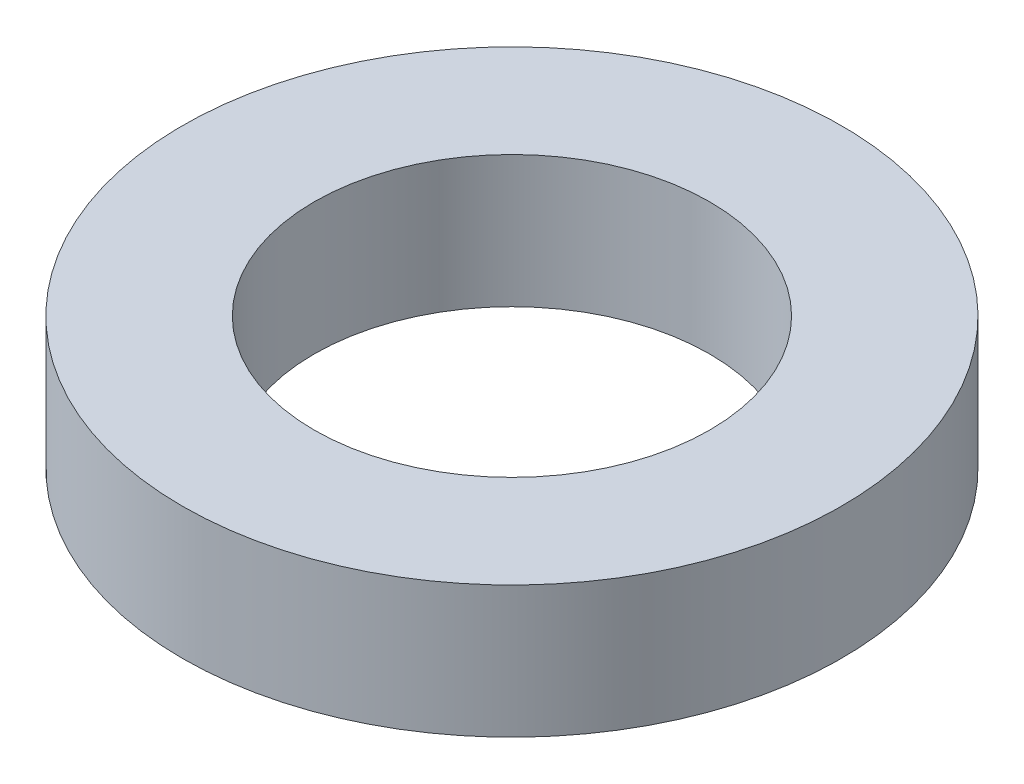
ISO-10303-21;
HEADER;
FILE_DESCRIPTION(('STEP AP214'),'2;1');
FILE_NAME('part.step','',(''),(''),'','','');
FILE_SCHEMA(('AUTOMOTIVE_DESIGN { 1 0 10303 214 1 1 1 1 }'));
ENDSEC;
DATA;
#1=APPLICATION_CONTEXT('core data for automotive mechanical design processes');
#2=APPLICATION_PROTOCOL_DEFINITION('international standard','automotive_design',2000,#1);
#3=PRODUCT_CONTEXT('',#1,'mechanical');
#4=PRODUCT('Part','Part','',(#3));
#5=PRODUCT_RELATED_PRODUCT_CATEGORY('part','',(#4));
#6=PRODUCT_DEFINITION_FORMATION('','',#4);
#7=PRODUCT_DEFINITION_CONTEXT('part definition',#1,'design');
#8=PRODUCT_DEFINITION('design','',#6,#7);
#9=PRODUCT_DEFINITION_SHAPE('','',#8);
#10=(LENGTH_UNIT() NAMED_UNIT(*) SI_UNIT(.MILLI.,.METRE.));
#11=(NAMED_UNIT(*) PLANE_ANGLE_UNIT() SI_UNIT($,.RADIAN.));
#12=(NAMED_UNIT(*) SI_UNIT($,.STERADIAN.) SOLID_ANGLE_UNIT());
#13=UNCERTAINTY_MEASURE_WITH_UNIT(LENGTH_MEASURE(1.E-05),#10,'distance_accuracy_value','');
#14=(GEOMETRIC_REPRESENTATION_CONTEXT(3) GLOBAL_UNCERTAINTY_ASSIGNED_CONTEXT((#13)) GLOBAL_UNIT_ASSIGNED_CONTEXT((#10,
#11,#12)) REPRESENTATION_CONTEXT('',''));
#15=CARTESIAN_POINT('',(0.,0.,0.));
#16=DIRECTION('',(0.,0.,1.));
#17=DIRECTION('',(1.,0.,0.));
#18=AXIS2_PLACEMENT_3D('',#15,#16,#17);
#19=CARTESIAN_POINT('',(0.,0.5,0.));
#20=DIRECTION('',(0.,1.,0.));
#21=DIRECTION('',(0.,0.,1.));
#22=AXIS2_PLACEMENT_3D('',#19,#20,#21);
#23=PLANE('',#22);
#24=CARTESIAN_POINT('',(0.,0.5,0.));
#25=DIRECTION('',(0.,1.,0.));
#26=DIRECTION('',(0.,0.,1.));
#27=AXIS2_PLACEMENT_3D('',#24,#25,#26);
#28=CIRCLE('',#27,2.5);
#29=CARTESIAN_POINT('',(0.,0.5,2.5));
#30=VERTEX_POINT('',#29);
#31=EDGE_CURVE('E10',#30,#30,#28,.T.);
#32=ORIENTED_EDGE('',*,*,#31,.T.);
#33=EDGE_LOOP('',(#32));
#34=FACE_BOUND('',#33,.T.);
#35=CARTESIAN_POINT('',(0.,0.5,0.));
#36=DIRECTION('',(0.,1.,0.));
#37=DIRECTION('',(0.,0.,1.));
#38=AXIS2_PLACEMENT_3D('',#35,#36,#37);
#39=CIRCLE('',#38,1.5);
#40=CARTESIAN_POINT('',(0.,0.5,1.5));
#41=VERTEX_POINT('',#40);
#42=EDGE_CURVE('E54',#41,#41,#39,.T.);
#43=ORIENTED_EDGE('',*,*,#42,.F.);
#44=EDGE_LOOP('',(#43));
#45=FACE_BOUND('',#44,.T.);
#46=ADVANCED_FACE('F41',(#34,#45),#23,.T.);
#47=CARTESIAN_POINT('',(0.,-0.5,0.));
#48=DIRECTION('',(0.,1.,0.));
#49=DIRECTION('',(0.,0.,1.));
#50=AXIS2_PLACEMENT_3D('',#47,#48,#49);
#51=PLANE('',#50);
#52=CARTESIAN_POINT('',(0.,-0.5,0.));
#53=DIRECTION('',(0.,1.,0.));
#54=DIRECTION('',(0.,0.,1.));
#55=AXIS2_PLACEMENT_3D('',#52,#53,#54);
#56=CIRCLE('',#55,2.5);
#57=CARTESIAN_POINT('',(0.,-0.5,2.5));
#58=VERTEX_POINT('',#57);
#59=EDGE_CURVE('E45',#58,#58,#56,.T.);
#60=ORIENTED_EDGE('',*,*,#59,.F.);
#61=EDGE_LOOP('',(#60));
#62=FACE_BOUND('',#61,.T.);
#63=CARTESIAN_POINT('',(0.,-0.5,0.));
#64=DIRECTION('',(0.,1.,0.));
#65=DIRECTION('',(0.,0.,1.));
#66=AXIS2_PLACEMENT_3D('',#63,#64,#65);
#67=CIRCLE('',#66,1.5);
#68=CARTESIAN_POINT('',(0.,-0.5,1.5));
#69=VERTEX_POINT('',#68);
#70=EDGE_CURVE('E56',#69,#69,#67,.T.);
#71=ORIENTED_EDGE('',*,*,#70,.T.);
#72=EDGE_LOOP('',(#71));
#73=FACE_BOUND('',#72,.T.);
#74=ADVANCED_FACE('F68',(#62,#73),#51,.F.);
#75=CARTESIAN_POINT('',(0.,0.5,0.));
#76=DIRECTION('',(0.,-1.,0.));
#77=DIRECTION('',(0.,0.,-1.));
#78=AXIS2_PLACEMENT_3D('',#75,#76,#77);
#79=CYLINDRICAL_SURFACE('',#78,2.5);
#80=ORIENTED_EDGE('',*,*,#31,.F.);
#81=EDGE_LOOP('',(#80));
#82=FACE_BOUND('',#81,.T.);
#83=ORIENTED_EDGE('',*,*,#59,.T.);
#84=EDGE_LOOP('',(#83));
#85=FACE_BOUND('',#84,.T.);
#86=ADVANCED_FACE('F43',(#82,#85),#79,.T.);
#87=CARTESIAN_POINT('',(0.,0.5,0.));
#88=DIRECTION('',(0.,-1.,0.));
#89=DIRECTION('',(0.,0.,-1.));
#90=AXIS2_PLACEMENT_3D('',#87,#88,#89);
#91=CYLINDRICAL_SURFACE('',#90,1.5);
#92=ORIENTED_EDGE('',*,*,#42,.T.);
#93=EDGE_LOOP('',(#92));
#94=FACE_BOUND('',#93,.T.);
#95=ORIENTED_EDGE('',*,*,#70,.F.);
#96=EDGE_LOOP('',(#95));
#97=FACE_BOUND('',#96,.T.);
#98=ADVANCED_FACE('F64',(#94,#97),#91,.F.);
#99=CLOSED_SHELL('',(#46,#74,#86,#98));
#100=MANIFOLD_SOLID_BREP('B2',#99);
#101=ADVANCED_BREP_SHAPE_REPRESENTATION('',(#18,#100),#14);
#102=SHAPE_DEFINITION_REPRESENTATION(#9,#101);
ENDSEC;
END-ISO-10303-21;
